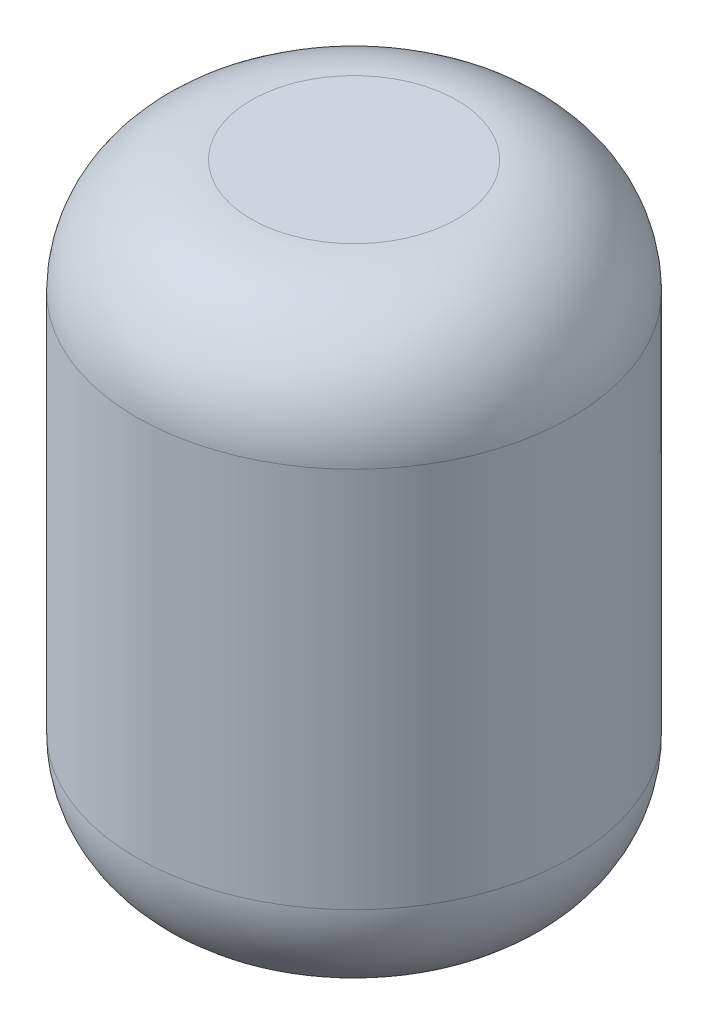
ISO-10303-21;
HEADER;
FILE_DESCRIPTION(('STEP AP214'),'2;1');
FILE_NAME('part.step','',(''),(''),'','','');
FILE_SCHEMA(('AUTOMOTIVE_DESIGN { 1 0 10303 214 1 1 1 1 }'));
ENDSEC;
DATA;
#1=APPLICATION_CONTEXT('core data for automotive mechanical design processes');
#2=APPLICATION_PROTOCOL_DEFINITION('international standard','automotive_design',2000,#1);
#3=PRODUCT_CONTEXT('',#1,'mechanical');
#4=PRODUCT('Part','Part','',(#3));
#5=PRODUCT_RELATED_PRODUCT_CATEGORY('part','',(#4));
#6=PRODUCT_DEFINITION_FORMATION('','',#4);
#7=PRODUCT_DEFINITION_CONTEXT('part definition',#1,'design');
#8=PRODUCT_DEFINITION('design','',#6,#7);
#9=PRODUCT_DEFINITION_SHAPE('','',#8);
#10=(LENGTH_UNIT() NAMED_UNIT(*) SI_UNIT(.MILLI.,.METRE.));
#11=(NAMED_UNIT(*) PLANE_ANGLE_UNIT() SI_UNIT($,.RADIAN.));
#12=(NAMED_UNIT(*) SI_UNIT($,.STERADIAN.) SOLID_ANGLE_UNIT());
#13=UNCERTAINTY_MEASURE_WITH_UNIT(LENGTH_MEASURE(1.E-05),#10,'distance_accuracy_value','');
#14=(GEOMETRIC_REPRESENTATION_CONTEXT(3) GLOBAL_UNCERTAINTY_ASSIGNED_CONTEXT((#13)) GLOBAL_UNIT_ASSIGNED_CONTEXT((#10,
#11,#12)) REPRESENTATION_CONTEXT('',''));
#15=CARTESIAN_POINT('',(0.,0.,0.));
#16=DIRECTION('',(0.,0.,1.));
#17=DIRECTION('',(1.,0.,0.));
#18=AXIS2_PLACEMENT_3D('',#15,#16,#17);
#19=CARTESIAN_POINT('',(0.,203.2,0.));
#20=DIRECTION('',(0.,-1.,0.));
#21=DIRECTION('',(0.,0.,-1.));
#22=AXIS2_PLACEMENT_3D('',#19,#20,#21);
#23=CYLINDRICAL_SURFACE('',#22,72.3885042016807);
#24=CARTESIAN_POINT('',(0.,38.1,0.));
#25=DIRECTION('',(0.,1.,0.));
#26=DIRECTION('',(0.,0.,1.));
#27=AXIS2_PLACEMENT_3D('',#24,#25,#26);
#28=CIRCLE('',#27,72.3885042016807);
#29=CARTESIAN_POINT('',(0.,38.1,72.3885042016807));
#30=VERTEX_POINT('',#29);
#31=EDGE_CURVE('E56',#30,#30,#28,.T.);
#32=ORIENTED_EDGE('',*,*,#31,.T.);
#33=EDGE_LOOP('',(#32));
#34=FACE_BOUND('',#33,.T.);
#35=CARTESIAN_POINT('',(0.,165.1,0.));
#36=DIRECTION('',(0.,1.,0.));
#37=DIRECTION('',(0.,0.,1.));
#38=AXIS2_PLACEMENT_3D('',#35,#36,#37);
#39=CIRCLE('',#38,72.3885042016807);
#40=CARTESIAN_POINT('',(0.,165.1,72.3885042016807));
#41=VERTEX_POINT('',#40);
#42=EDGE_CURVE('E60',#41,#41,#39,.F.);
#43=ORIENTED_EDGE('',*,*,#42,.T.);
#44=EDGE_LOOP('',(#43));
#45=FACE_BOUND('',#44,.T.);
#46=ADVANCED_FACE('F45',(#34,#45),#23,.T.);
#47=CARTESIAN_POINT('',(0.,203.2,0.));
#48=DIRECTION('',(0.,1.,0.));
#49=DIRECTION('',(0.,0.,1.));
#50=AXIS2_PLACEMENT_3D('',#47,#48,#49);
#51=PLANE('',#50);
#52=CARTESIAN_POINT('',(0.,203.2,0.));
#53=DIRECTION('',(0.,1.,0.));
#54=DIRECTION('',(0.,0.,1.));
#55=AXIS2_PLACEMENT_3D('',#52,#53,#54);
#56=CIRCLE('',#55,34.2885042016807);
#57=CARTESIAN_POINT('',(0.,203.2,34.2885042016807));
#58=VERTEX_POINT('',#57);
#59=EDGE_CURVE('E10',#58,#58,#56,.T.);
#60=ORIENTED_EDGE('',*,*,#59,.T.);
#61=EDGE_LOOP('',(#60));
#62=FACE_BOUND('',#61,.T.);
#63=ADVANCED_FACE('F76',(#62),#51,.T.);
#64=CARTESIAN_POINT('',(0.,0.,0.));
#65=DIRECTION('',(0.,1.,0.));
#66=DIRECTION('',(0.,0.,1.));
#67=AXIS2_PLACEMENT_3D('',#64,#65,#66);
#68=PLANE('',#67);
#69=CARTESIAN_POINT('',(0.,0.,0.));
#70=DIRECTION('',(0.,1.,0.));
#71=DIRECTION('',(0.,0.,1.));
#72=AXIS2_PLACEMENT_3D('',#69,#70,#71);
#73=CIRCLE('',#72,34.2885042016807);
#74=CARTESIAN_POINT('',(0.,0.,34.2885042016807));
#75=VERTEX_POINT('',#74);
#76=EDGE_CURVE('E52',#75,#75,#73,.F.);
#77=ORIENTED_EDGE('',*,*,#76,.T.);
#78=EDGE_LOOP('',(#77));
#79=FACE_BOUND('',#78,.T.);
#80=ADVANCED_FACE('F73',(#79),#68,.F.);
#81=CARTESIAN_POINT('',(0.,38.1,0.));
#82=DIRECTION('',(0.,1.,0.));
#83=DIRECTION('',(0.,0.,1.));
#84=AXIS2_PLACEMENT_3D('',#81,#82,#83);
#85=DEGENERATE_TOROIDAL_SURFACE('',#84,34.2885042016807,38.1,.T.);
#86=ORIENTED_EDGE('',*,*,#76,.F.);
#87=EDGE_LOOP('',(#86));
#88=FACE_BOUND('',#87,.T.);
#89=ORIENTED_EDGE('',*,*,#31,.F.);
#90=EDGE_LOOP('',(#89));
#91=FACE_BOUND('',#90,.T.);
#92=ADVANCED_FACE('F69',(#88,#91),#85,.T.);
#93=CARTESIAN_POINT('',(0.,165.1,0.));
#94=DIRECTION('',(0.,1.,0.));
#95=DIRECTION('',(0.,0.,1.));
#96=AXIS2_PLACEMENT_3D('',#93,#94,#95);
#97=DEGENERATE_TOROIDAL_SURFACE('',#96,34.2885042016807,38.1,.T.);
#98=ORIENTED_EDGE('',*,*,#42,.F.);
#99=EDGE_LOOP('',(#98));
#100=FACE_BOUND('',#99,.T.);
#101=ORIENTED_EDGE('',*,*,#59,.F.);
#102=EDGE_LOOP('',(#101));
#103=FACE_BOUND('',#102,.T.);
#104=ADVANCED_FACE('F47',(#100,#103),#97,.T.);
#105=CLOSED_SHELL('',(#46,#63,#80,#92,#104));
#106=MANIFOLD_SOLID_BREP('B2',#105);
#107=ADVANCED_BREP_SHAPE_REPRESENTATION('',(#18,#106),#14);
#108=SHAPE_DEFINITION_REPRESENTATION(#9,#107);
ENDSEC;
END-ISO-10303-21;
